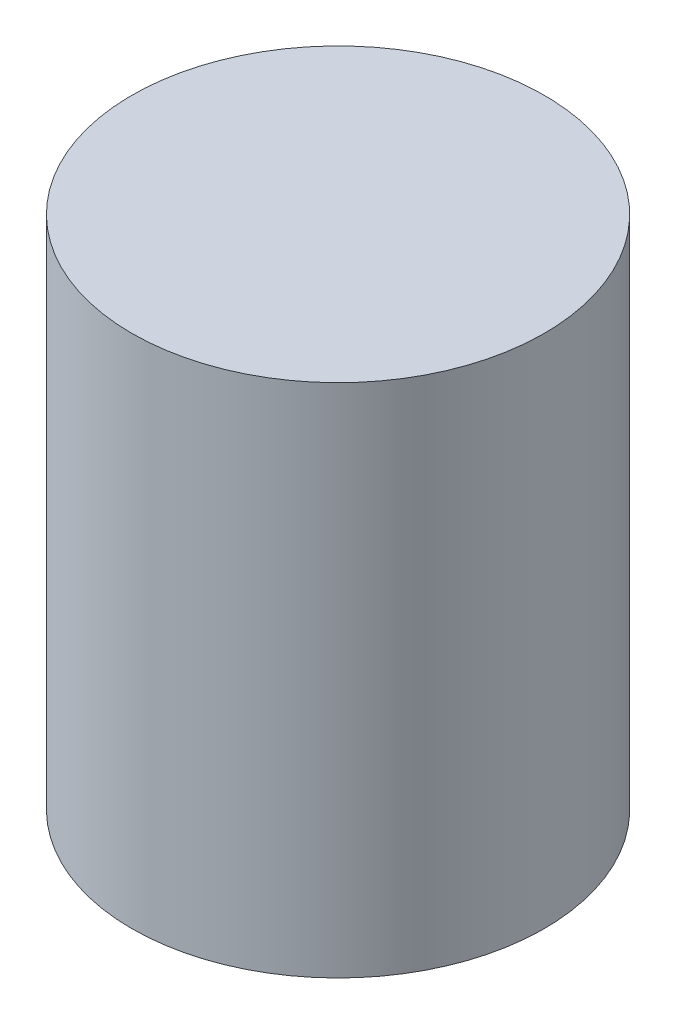
ISO-10303-21;
HEADER;
FILE_DESCRIPTION(('STEP AP214'),'2;1');
FILE_NAME('part.step','',(''),(''),'','','');
FILE_SCHEMA(('AUTOMOTIVE_DESIGN { 1 0 10303 214 1 1 1 1 }'));
ENDSEC;
DATA;
#1=APPLICATION_CONTEXT('core data for automotive mechanical design processes');
#2=APPLICATION_PROTOCOL_DEFINITION('international standard','automotive_design',2000,#1);
#3=PRODUCT_CONTEXT('',#1,'mechanical');
#4=PRODUCT('Part','Part','',(#3));
#5=PRODUCT_RELATED_PRODUCT_CATEGORY('part','',(#4));
#6=PRODUCT_DEFINITION_FORMATION('','',#4);
#7=PRODUCT_DEFINITION_CONTEXT('part definition',#1,'design');
#8=PRODUCT_DEFINITION('design','',#6,#7);
#9=PRODUCT_DEFINITION_SHAPE('','',#8);
#10=(LENGTH_UNIT() NAMED_UNIT(*) SI_UNIT(.MILLI.,.METRE.));
#11=(NAMED_UNIT(*) PLANE_ANGLE_UNIT() SI_UNIT($,.RADIAN.));
#12=(NAMED_UNIT(*) SI_UNIT($,.STERADIAN.) SOLID_ANGLE_UNIT());
#13=UNCERTAINTY_MEASURE_WITH_UNIT(LENGTH_MEASURE(1.E-05),#10,'distance_accuracy_value','');
#14=(GEOMETRIC_REPRESENTATION_CONTEXT(3) GLOBAL_UNCERTAINTY_ASSIGNED_CONTEXT((#13)) GLOBAL_UNIT_ASSIGNED_CONTEXT((#10,
#11,#12)) REPRESENTATION_CONTEXT('',''));
#15=CARTESIAN_POINT('',(0.,0.,0.));
#16=DIRECTION('',(0.,0.,1.));
#17=DIRECTION('',(1.,0.,0.));
#18=AXIS2_PLACEMENT_3D('',#15,#16,#17);
#19=CARTESIAN_POINT('',(0.,25.,0.));
#20=DIRECTION('',(0.,-1.,0.));
#21=DIRECTION('',(0.,0.,-1.));
#22=AXIS2_PLACEMENT_3D('',#19,#20,#21);
#23=CYLINDRICAL_SURFACE('',#22,10.);
#24=CARTESIAN_POINT('',(0.,25.,0.));
#25=DIRECTION('',(0.,1.,0.));
#26=DIRECTION('',(0.,0.,1.));
#27=AXIS2_PLACEMENT_3D('',#24,#25,#26);
#28=CIRCLE('',#27,10.);
#29=CARTESIAN_POINT('',(0.,25.,10.));
#30=VERTEX_POINT('',#29);
#31=EDGE_CURVE('E10',#30,#30,#28,.T.);
#32=ORIENTED_EDGE('',*,*,#31,.F.);
#33=EDGE_LOOP('',(#32));
#34=FACE_BOUND('',#33,.T.);
#35=CARTESIAN_POINT('',(0.,0.,0.));
#36=DIRECTION('',(0.,1.,0.));
#37=DIRECTION('',(0.,0.,1.));
#38=AXIS2_PLACEMENT_3D('',#35,#36,#37);
#39=CIRCLE('',#38,10.);
#40=CARTESIAN_POINT('',(0.,0.,10.));
#41=VERTEX_POINT('',#40);
#42=EDGE_CURVE('E40',#41,#41,#39,.T.);
#43=ORIENTED_EDGE('',*,*,#42,.T.);
#44=EDGE_LOOP('',(#43));
#45=FACE_BOUND('',#44,.T.);
#46=ADVANCED_FACE('F37',(#34,#45),#23,.T.);
#47=CARTESIAN_POINT('',(0.,25.,0.));
#48=DIRECTION('',(0.,1.,0.));
#49=DIRECTION('',(0.,0.,1.));
#50=AXIS2_PLACEMENT_3D('',#47,#48,#49);
#51=PLANE('',#50);
#52=ORIENTED_EDGE('',*,*,#31,.T.);
#53=EDGE_LOOP('',(#52));
#54=FACE_BOUND('',#53,.T.);
#55=ADVANCED_FACE('F52',(#54),#51,.T.);
#56=CARTESIAN_POINT('',(0.,0.,0.));
#57=DIRECTION('',(0.,1.,0.));
#58=DIRECTION('',(0.,0.,1.));
#59=AXIS2_PLACEMENT_3D('',#56,#57,#58);
#60=PLANE('',#59);
#61=ORIENTED_EDGE('',*,*,#42,.F.);
#62=EDGE_LOOP('',(#61));
#63=FACE_BOUND('',#62,.T.);
#64=ADVANCED_FACE('F50',(#63),#60,.F.);
#65=CLOSED_SHELL('',(#46,#55,#64));
#66=MANIFOLD_SOLID_BREP('B2',#65);
#67=ADVANCED_BREP_SHAPE_REPRESENTATION('',(#18,#66),#14);
#68=SHAPE_DEFINITION_REPRESENTATION(#9,#67);
ENDSEC;
END-ISO-10303-21;
